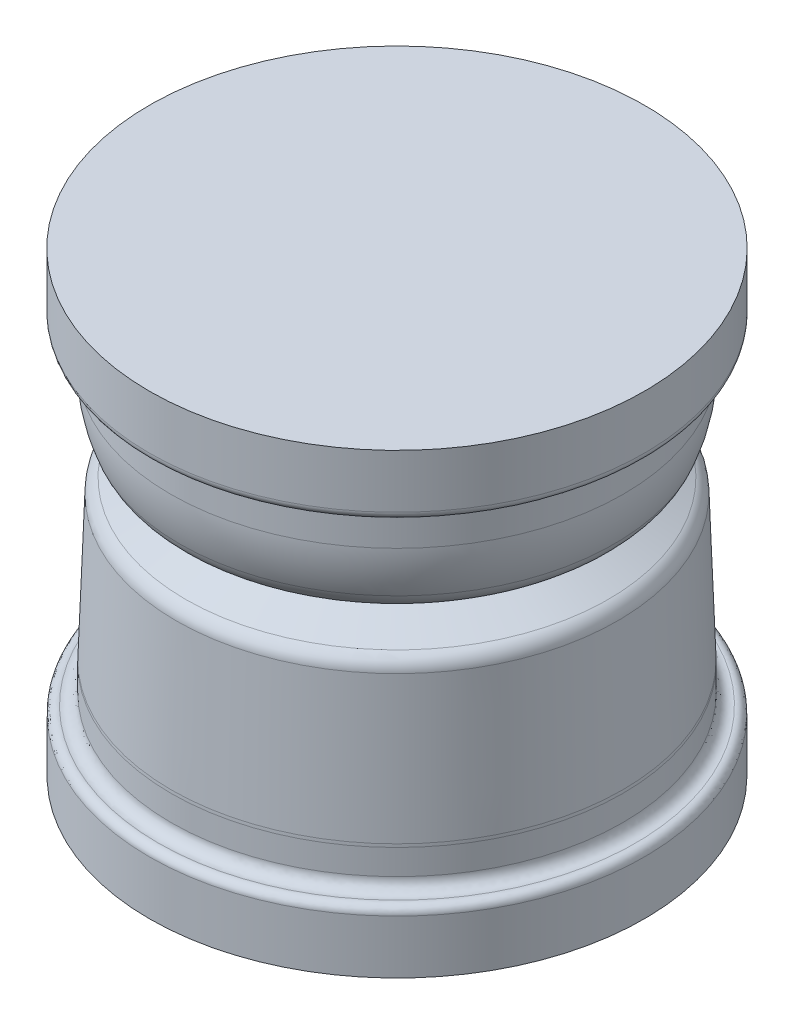
ISO-10303-21;
HEADER;
FILE_DESCRIPTION(('STEP AP214'),'2;1');
FILE_NAME('part.step','',(''),(''),'','','');
FILE_SCHEMA(('AUTOMOTIVE_DESIGN { 1 0 10303 214 1 1 1 1 }'));
ENDSEC;
DATA;
#1=APPLICATION_CONTEXT('core data for automotive mechanical design processes');
#2=APPLICATION_PROTOCOL_DEFINITION('international standard','automotive_design',2000,#1);
#3=PRODUCT_CONTEXT('',#1,'mechanical');
#4=PRODUCT('Part','Part','',(#3));
#5=PRODUCT_RELATED_PRODUCT_CATEGORY('part','',(#4));
#6=PRODUCT_DEFINITION_FORMATION('','',#4);
#7=PRODUCT_DEFINITION_CONTEXT('part definition',#1,'design');
#8=PRODUCT_DEFINITION('design','',#6,#7);
#9=PRODUCT_DEFINITION_SHAPE('','',#8);
#10=(LENGTH_UNIT() NAMED_UNIT(*) SI_UNIT(.MILLI.,.METRE.));
#11=(NAMED_UNIT(*) PLANE_ANGLE_UNIT() SI_UNIT($,.RADIAN.));
#12=(NAMED_UNIT(*) SI_UNIT($,.STERADIAN.) SOLID_ANGLE_UNIT());
#13=UNCERTAINTY_MEASURE_WITH_UNIT(LENGTH_MEASURE(1.E-05),#10,'distance_accuracy_value','');
#14=(GEOMETRIC_REPRESENTATION_CONTEXT(3) GLOBAL_UNCERTAINTY_ASSIGNED_CONTEXT((#13)) GLOBAL_UNIT_ASSIGNED_CONTEXT((#10,
#11,#12)) REPRESENTATION_CONTEXT('',''));
#15=CARTESIAN_POINT('',(0.,0.,0.));
#16=DIRECTION('',(0.,0.,1.));
#17=DIRECTION('',(1.,0.,0.));
#18=AXIS2_PLACEMENT_3D('',#15,#16,#17);
#19=CARTESIAN_POINT('',(0.,-108.124708626121,133.519735500002));
#20=CARTESIAN_POINT('',(0.,-108.789131090786,128.834697888006));
#21=CARTESIAN_POINT('',(0.,-105.359484803612,126.302452500002));
#22=CARTESIAN_POINT('',(0.,-101.837246578522,126.302452500002));
#23=(BOUNDED_CURVE() B_SPLINE_CURVE(3,(#19,#20,#21,#22),.UNSPECIFIED.,.F.,
.F.) B_SPLINE_CURVE_WITH_KNOTS((4,4),(0.,1.),
.UNSPECIFIED.) CURVE() GEOMETRIC_REPRESENTATION_ITEM() RATIONAL_B_SPLINE_CURVE((0.255591691964593,
0.242825015050018,0.327183181081988,0.508666190060503)) REPRESENTATION_ITEM(''));
#24=CARTESIAN_POINT('',(0.,55.,0.));
#25=DIRECTION('',(0.,1.,0.));
#26=AXIS1_PLACEMENT('',#24,#25);
#27=SURFACE_OF_REVOLUTION('',#23,#26);
#28=CARTESIAN_POINT('',(0.,-101.837246578522,0.));
#29=DIRECTION('',(0.,1.,0.));
#30=DIRECTION('',(0.,0.,1.));
#31=AXIS2_PLACEMENT_3D('',#28,#29,#30);
#32=CIRCLE('',#31,126.302452500002);
#33=CARTESIAN_POINT('',(0.,-101.837246578522,126.302452500002));
#34=VERTEX_POINT('',#33);
#35=EDGE_CURVE('E93',#34,#34,#32,.T.);
#36=ORIENTED_EDGE('',*,*,#35,.F.);
#37=EDGE_LOOP('',(#36));
#38=FACE_BOUND('',#37,.T.);
#39=CARTESIAN_POINT('',(0.,-108.124708626121,0.));
#40=DIRECTION('',(0.,1.,0.));
#41=DIRECTION('',(0.,0.,1.));
#42=AXIS2_PLACEMENT_3D('',#39,#40,#41);
#43=CIRCLE('',#42,133.519735500002);
#44=CARTESIAN_POINT('',(0.,-108.124708626121,133.519735500002));
#45=VERTEX_POINT('',#44);
#46=EDGE_CURVE('E10',#45,#45,#43,.T.);
#47=ORIENTED_EDGE('',*,*,#46,.T.);
#48=EDGE_LOOP('',(#47));
#49=FACE_BOUND('',#48,.T.);
#50=ADVANCED_FACE('F34',(#38,#49),#27,.T.);
#51=CARTESIAN_POINT('',(0.,-108.124708626121,133.519735500002));
#52=CARTESIAN_POINT('',(0.,-107.672901350149,136.70556107616));
#53=CARTESIAN_POINT('',(0.,-110.005060825427,138.427487940002));
#54=CARTESIAN_POINT('',(0.,-112.400182818489,138.427487940002));
#55=(BOUNDED_CURVE() B_SPLINE_CURVE(3,(#51,#52,#53,#54),.UNSPECIFIED.,.F.,
.F.) B_SPLINE_CURVE_WITH_KNOTS((4,4),(0.,1.),
.UNSPECIFIED.) CURVE() GEOMETRIC_REPRESENTATION_ITEM() RATIONAL_B_SPLINE_CURVE((0.255591691964592,
0.242825015050017,0.327183181081988,0.508666190060503)) REPRESENTATION_ITEM(''));
#56=CARTESIAN_POINT('',(0.,55.,0.));
#57=DIRECTION('',(0.,1.,0.));
#58=AXIS1_PLACEMENT('',#56,#57);
#59=SURFACE_OF_REVOLUTION('',#55,#58);
#60=CARTESIAN_POINT('',(0.,-112.400182818489,0.));
#61=DIRECTION('',(0.,1.,0.));
#62=DIRECTION('',(0.,0.,1.));
#63=AXIS2_PLACEMENT_3D('',#60,#61,#62);
#64=CIRCLE('',#63,138.427487940002);
#65=CARTESIAN_POINT('',(0.,-112.400182818489,138.427487940002));
#66=VERTEX_POINT('',#65);
#67=EDGE_CURVE('E41',#66,#66,#64,.T.);
#68=ORIENTED_EDGE('',*,*,#67,.T.);
#69=EDGE_LOOP('',(#68));
#70=FACE_BOUND('',#69,.T.);
#71=ORIENTED_EDGE('',*,*,#46,.F.);
#72=EDGE_LOOP('',(#71));
#73=FACE_BOUND('',#72,.T.);
#74=ADVANCED_FACE('F157',(#70,#73),#59,.F.);
#75=CARTESIAN_POINT('',(0.,55.,0.));
#76=DIRECTION('',(0.,1.,0.));
#77=DIRECTION('',(0.,0.,1.));
#78=AXIS2_PLACEMENT_3D('',#75,#76,#77);
#79=CYLINDRICAL_SURFACE('',#78,138.427487940002);
#80=CARTESIAN_POINT('',(0.,-142.400182818489,0.));
#81=DIRECTION('',(0.,1.,0.));
#82=DIRECTION('',(0.,0.,1.));
#83=AXIS2_PLACEMENT_3D('',#80,#81,#82);
#84=CIRCLE('',#83,138.427487940002);
#85=CARTESIAN_POINT('',(0.,-142.400182818489,138.427487940002));
#86=VERTEX_POINT('',#85);
#87=EDGE_CURVE('E45',#86,#86,#84,.T.);
#88=ORIENTED_EDGE('',*,*,#87,.T.);
#89=EDGE_LOOP('',(#88));
#90=FACE_BOUND('',#89,.T.);
#91=ORIENTED_EDGE('',*,*,#67,.F.);
#92=EDGE_LOOP('',(#91));
#93=FACE_BOUND('',#92,.T.);
#94=ADVANCED_FACE('F154',(#90,#93),#79,.T.);
#95=CARTESIAN_POINT('',(0.,-142.400182818489,0.));
#96=DIRECTION('',(0.,1.,0.));
#97=DIRECTION('',(0.,0.,1.));
#98=AXIS2_PLACEMENT_3D('',#95,#96,#97);
#99=PLANE('',#98);
#100=ORIENTED_EDGE('',*,*,#87,.F.);
#101=EDGE_LOOP('',(#100));
#102=FACE_BOUND('',#101,.T.);
#103=ADVANCED_FACE('F150',(#102),#99,.F.);
#104=CARTESIAN_POINT('',(0.,113.365316058993,0.));
#105=DIRECTION('',(0.,-1.,0.));
#106=DIRECTION('',(0.,0.,-1.));
#107=AXIS2_PLACEMENT_3D('',#104,#105,#106);
#108=PLANE('',#107);
#109=CARTESIAN_POINT('',(0.,113.365316058993,0.));
#110=DIRECTION('',(0.,1.,0.));
#111=DIRECTION('',(0.,0.,1.));
#112=AXIS2_PLACEMENT_3D('',#109,#110,#111);
#113=CIRCLE('',#112,138.555289406168);
#114=CARTESIAN_POINT('',(0.,113.365316058993,138.555289406168));
#115=VERTEX_POINT('',#114);
#116=EDGE_CURVE('E49',#115,#115,#113,.T.);
#117=ORIENTED_EDGE('',*,*,#116,.T.);
#118=EDGE_LOOP('',(#117));
#119=FACE_BOUND('',#118,.T.);
#120=ADVANCED_FACE('F146',(#119),#108,.F.);
#121=CARTESIAN_POINT('',(0.,55.,0.));
#122=DIRECTION('',(0.,1.,0.));
#123=DIRECTION('',(0.,0.,1.));
#124=AXIS2_PLACEMENT_3D('',#121,#122,#123);
#125=CYLINDRICAL_SURFACE('',#124,138.555289406168);
#126=ORIENTED_EDGE('',*,*,#116,.F.);
#127=EDGE_LOOP('',(#126));
#128=FACE_BOUND('',#127,.T.);
#129=CARTESIAN_POINT('',(0.,83.3653160589928,0.));
#130=DIRECTION('',(0.,1.,0.));
#131=DIRECTION('',(0.,0.,1.));
#132=AXIS2_PLACEMENT_3D('',#129,#130,#131);
#133=CIRCLE('',#132,138.555289406168);
#134=CARTESIAN_POINT('',(0.,83.3653160589928,138.555289406168));
#135=VERTEX_POINT('',#134);
#136=EDGE_CURVE('E54',#135,#135,#133,.T.);
#137=ORIENTED_EDGE('',*,*,#136,.T.);
#138=EDGE_LOOP('',(#137));
#139=FACE_BOUND('',#138,.T.);
#140=ADVANCED_FACE('F142',(#128,#139),#125,.T.);
#141=CARTESIAN_POINT('',(0.,83.2420105318187,0.));
#142=DIRECTION('',(0.,1.,0.));
#143=DIRECTION('',(0.,0.,1.));
#144=AXIS2_PLACEMENT_3D('',#141,#142,#143);
#145=TOROIDAL_SURFACE('',#144,134.112,4.44499999999991);
#146=CARTESIAN_POINT('',(0.,78.8192913738797,0.));
#147=DIRECTION('',(0.,1.,0.));
#148=DIRECTION('',(0.,0.,1.));
#149=AXIS2_PLACEMENT_3D('',#146,#147,#148);
#150=CIRCLE('',#149,133.667500000001);
#151=CARTESIAN_POINT('',(0.,78.8192913738797,133.667500000001));
#152=VERTEX_POINT('',#151);
#153=EDGE_CURVE('E57',#152,#152,#150,.T.);
#154=ORIENTED_EDGE('',*,*,#153,.T.);
#155=EDGE_LOOP('',(#154));
#156=FACE_BOUND('',#155,.T.);
#157=ORIENTED_EDGE('',*,*,#136,.F.);
#158=EDGE_LOOP('',(#157));
#159=FACE_BOUND('',#158,.T.);
#160=ADVANCED_FACE('F138',(#156,#159),#145,.T.);
#161=CARTESIAN_POINT('',(0.,72.5011211482528,0.));
#162=DIRECTION('',(0.,1.,0.));
#163=DIRECTION('',(0.,0.,1.));
#164=AXIS2_PLACEMENT_3D('',#161,#162,#163);
#165=TOROIDAL_SURFACE('',#164,133.0325,6.34999999999996);
#166=ORIENTED_EDGE('',*,*,#153,.F.);
#167=EDGE_LOOP('',(#166));
#168=FACE_BOUND('',#167,.T.);
#169=CARTESIAN_POINT('',(0.,72.5011211482528,0.));
#170=DIRECTION('',(0.,1.,0.));
#171=DIRECTION('',(0.,0.,1.));
#172=AXIS2_PLACEMENT_3D('',#169,#170,#171);
#173=CIRCLE('',#172,126.6825);
#174=CARTESIAN_POINT('',(0.,72.5011211482528,126.6825));
#175=VERTEX_POINT('',#174);
#176=EDGE_CURVE('E60',#175,#175,#173,.T.);
#177=ORIENTED_EDGE('',*,*,#176,.T.);
#178=EDGE_LOOP('',(#177));
#179=FACE_BOUND('',#178,.T.);
#180=ADVANCED_FACE('F134',(#168,#179),#165,.F.);
#181=CARTESIAN_POINT('',(0.,55.,0.));
#182=DIRECTION('',(0.,1.,0.));
#183=DIRECTION('',(0.,0.,1.));
#184=AXIS2_PLACEMENT_3D('',#181,#182,#183);
#185=CYLINDRICAL_SURFACE('',#184,126.6825);
#186=CARTESIAN_POINT('',(0.,57.5011211482528,0.));
#187=DIRECTION('',(0.,1.,0.));
#188=DIRECTION('',(0.,0.,1.));
#189=AXIS2_PLACEMENT_3D('',#186,#187,#188);
#190=CIRCLE('',#189,126.6825);
#191=CARTESIAN_POINT('',(0.,57.5011211482528,126.6825));
#192=VERTEX_POINT('',#191);
#193=EDGE_CURVE('E63',#192,#192,#190,.T.);
#194=ORIENTED_EDGE('',*,*,#193,.T.);
#195=EDGE_LOOP('',(#194));
#196=FACE_BOUND('',#195,.T.);
#197=ORIENTED_EDGE('',*,*,#176,.F.);
#198=EDGE_LOOP('',(#197));
#199=FACE_BOUND('',#198,.T.);
#200=ADVANCED_FACE('F130',(#196,#199),#185,.T.);
#201=CARTESIAN_POINT('',(0.,57.5011211482528,0.));
#202=DIRECTION('',(0.,1.,0.));
#203=DIRECTION('',(0.,0.,1.));
#204=AXIS2_PLACEMENT_3D('',#201,#202,#203);
#205=DEGENERATE_TOROIDAL_SURFACE('',#204,54.0473043126088,72.6351956873913,.T.);
#206=ORIENTED_EDGE('',*,*,#193,.F.);
#207=EDGE_LOOP('',(#206));
#208=FACE_BOUND('',#207,.T.);
#209=CARTESIAN_POINT('',(0.,30.8840402786734,0.));
#210=DIRECTION('',(0.,1.,0.));
#211=DIRECTION('',(0.,0.,1.));
#212=AXIS2_PLACEMENT_3D('',#209,#210,#211);
#213=CIRCLE('',#212,121.629866105781);
#214=CARTESIAN_POINT('',(0.,30.8840402786734,121.629866105781));
#215=VERTEX_POINT('',#214);
#216=EDGE_CURVE('E66',#215,#215,#213,.T.);
#217=ORIENTED_EDGE('',*,*,#216,.T.);
#218=EDGE_LOOP('',(#217));
#219=FACE_BOUND('',#218,.T.);
#220=ADVANCED_FACE('F126',(#208,#219),#205,.T.);
#221=CARTESIAN_POINT('',(0.,37.6315363697442,0.));
#222=DIRECTION('',(0.,1.,0.));
#223=DIRECTION('',(0.,0.,1.));
#224=AXIS2_PLACEMENT_3D('',#221,#222,#223);
#225=TOROIDAL_SURFACE('',#224,104.49751888264,18.4132024610953);
#226=CARTESIAN_POINT('',(0.,20.9524825050762,0.));
#227=DIRECTION('',(0.,1.,0.));
#228=DIRECTION('',(0.,0.,1.));
#229=AXIS2_PLACEMENT_3D('',#226,#227,#228);
#230=CIRCLE('',#229,112.298492350919);
#231=CARTESIAN_POINT('',(0.,20.9524825050762,112.298492350919));
#232=VERTEX_POINT('',#231);
#233=EDGE_CURVE('E69',#232,#232,#230,.T.);
#234=ORIENTED_EDGE('',*,*,#233,.T.);
#235=EDGE_LOOP('',(#234));
#236=FACE_BOUND('',#235,.T.);
#237=ORIENTED_EDGE('',*,*,#216,.F.);
#238=EDGE_LOOP('',(#237));
#239=FACE_BOUND('',#238,.T.);
#240=ADVANCED_FACE('F122',(#236,#239),#225,.T.);
#241=CARTESIAN_POINT('',(0.,14.832128030832,0.));
#242=DIRECTION('',(0.,1.,0.));
#243=DIRECTION('',(0.,0.,1.));
#244=AXIS2_PLACEMENT_3D('',#241,#242,#243);
#245=CONICAL_SURFACE('',#244,99.2127252525066,1.13331210913786);
#246=ORIENTED_EDGE('',*,*,#233,.F.);
#247=EDGE_LOOP('',(#246));
#248=FACE_BOUND('',#247,.T.);
#249=CARTESIAN_POINT('',(0.,14.832128030832,0.));
#250=DIRECTION('',(0.,1.,0.));
#251=DIRECTION('',(0.,0.,1.));
#252=AXIS2_PLACEMENT_3D('',#249,#250,#251);
#253=CIRCLE('',#252,99.2127252525066);
#254=CARTESIAN_POINT('',(0.,14.832128030832,99.2127252525066));
#255=VERTEX_POINT('',#254);
#256=EDGE_CURVE('E72',#255,#255,#253,.T.);
#257=ORIENTED_EDGE('',*,*,#256,.T.);
#258=EDGE_LOOP('',(#257));
#259=FACE_BOUND('',#258,.T.);
#260=ADVANCED_FACE('F118',(#248,#259),#245,.T.);
#261=CARTESIAN_POINT('',(0.,13.0472913738795,91.1860000000004));
#262=CARTESIAN_POINT('',(0.,13.0472913738794,93.9930756489206));
#263=CARTESIAN_POINT('',(0.,13.6614165071201,96.7096580848795));
#264=CARTESIAN_POINT('',(0.,14.832128030832,99.2127252525066));
#265=(BOUNDED_CURVE() B_SPLINE_CURVE(3,(#261,#262,#263,#264),.UNSPECIFIED.,.F.,
.F.) B_SPLINE_CURVE_WITH_KNOTS((4,4),(0.,1.),
.UNSPECIFIED.) CURVE() GEOMETRIC_REPRESENTATION_ITEM() RATIONAL_B_SPLINE_CURVE((0.254333095030252,
0.254333095030252,0.258499793724843,0.266833191114025)) REPRESENTATION_ITEM(''));
#266=CARTESIAN_POINT('',(0.,55.,0.));
#267=DIRECTION('',(0.,1.,0.));
#268=AXIS1_PLACEMENT('',#266,#267);
#269=SURFACE_OF_REVOLUTION('',#265,#268);
#270=ORIENTED_EDGE('',*,*,#256,.F.);
#271=EDGE_LOOP('',(#270));
#272=FACE_BOUND('',#271,.T.);
#273=CARTESIAN_POINT('',(0.,13.0472913738796,0.));
#274=DIRECTION('',(0.,1.,0.));
#275=DIRECTION('',(0.,0.,1.));
#276=AXIS2_PLACEMENT_3D('',#273,#274,#275);
#277=CIRCLE('',#276,91.1860000000005);
#278=CARTESIAN_POINT('',(0.,13.0472913738796,91.1860000000005));
#279=VERTEX_POINT('',#278);
#280=EDGE_CURVE('E75',#279,#279,#277,.T.);
#281=ORIENTED_EDGE('',*,*,#280,.T.);
#282=EDGE_LOOP('',(#281));
#283=FACE_BOUND('',#282,.T.);
#284=ADVANCED_FACE('F113',(#272,#283),#269,.T.);
#285=CARTESIAN_POINT('',(0.,13.0472913738796,91.1860000000004));
#286=CARTESIAN_POINT('',(0.,13.0472913738796,93.9930756489206));
#287=CARTESIAN_POINT('',(0.,12.4331662406387,96.7096580848795));
#288=CARTESIAN_POINT('',(0.,11.2624547169268,99.2127252525065));
#289=(BOUNDED_CURVE() B_SPLINE_CURVE(3,(#285,#286,#287,#288),.UNSPECIFIED.,.F.,
.F.) B_SPLINE_CURVE_WITH_KNOTS((4,4),(0.,1.),
.UNSPECIFIED.) CURVE() GEOMETRIC_REPRESENTATION_ITEM() RATIONAL_B_SPLINE_CURVE((0.254333095030252,
0.254333095030252,0.258499793724843,0.266833191114025)) REPRESENTATION_ITEM(''));
#290=CARTESIAN_POINT('',(0.,55.,0.));
#291=DIRECTION('',(0.,1.,0.));
#292=AXIS1_PLACEMENT('',#290,#291);
#293=SURFACE_OF_REVOLUTION('',#289,#292);
#294=CARTESIAN_POINT('',(0.,11.2624547169268,0.));
#295=DIRECTION('',(0.,1.,0.));
#296=DIRECTION('',(0.,0.,1.));
#297=AXIS2_PLACEMENT_3D('',#294,#295,#296);
#298=CIRCLE('',#297,99.2127252525065);
#299=CARTESIAN_POINT('',(0.,11.2624547169268,99.2127252525065));
#300=VERTEX_POINT('',#299);
#301=EDGE_CURVE('E78',#300,#300,#298,.T.);
#302=ORIENTED_EDGE('',*,*,#301,.T.);
#303=EDGE_LOOP('',(#302));
#304=FACE_BOUND('',#303,.T.);
#305=ORIENTED_EDGE('',*,*,#280,.F.);
#306=EDGE_LOOP('',(#305));
#307=FACE_BOUND('',#306,.T.);
#308=ADVANCED_FACE('F108',(#304,#307),#293,.F.);
#309=CARTESIAN_POINT('',(0.,11.2624547169268,0.));
#310=DIRECTION('',(0.,-1.,0.));
#311=DIRECTION('',(0.,0.,-1.));
#312=AXIS2_PLACEMENT_3D('',#309,#310,#311);
#313=CONICAL_SURFACE('',#312,99.2127252525065,1.13331210913781);
#314=CARTESIAN_POINT('',(0.,2.34433380954261,0.));
#315=DIRECTION('',(0.,1.,0.));
#316=DIRECTION('',(0.,0.,1.));
#317=AXIS2_PLACEMENT_3D('',#314,#315,#316);
#318=CIRCLE('',#317,118.280322340321);
#319=CARTESIAN_POINT('',(0.,2.34433380954261,118.280322340321));
#320=VERTEX_POINT('',#319);
#321=EDGE_CURVE('E81',#320,#320,#318,.T.);
#322=ORIENTED_EDGE('',*,*,#321,.T.);
#323=EDGE_LOOP('',(#322));
#324=FACE_BOUND('',#323,.T.);
#325=ORIENTED_EDGE('',*,*,#301,.F.);
#326=EDGE_LOOP('',(#325));
#327=FACE_BOUND('',#326,.T.);
#328=ADVANCED_FACE('F112',(#324,#327),#313,.T.);
#329=CARTESIAN_POINT('',(0.,-5.80804951971132,0.));
#330=DIRECTION('',(0.,1.,0.));
#331=DIRECTION('',(0.,0.,1.));
#332=AXIS2_PLACEMENT_3D('',#329,#330,#331);
#333=TOROIDAL_SURFACE('',#332,114.46736468872,9.);
#334=CARTESIAN_POINT('',(0.,-5.49395404938885,0.));
#335=DIRECTION('',(0.,1.,0.));
#336=DIRECTION('',(0.,0.,1.));
#337=AXIS2_PLACEMENT_3D('',#334,#335,#336);
#338=CIRCLE('',#337,123.461882131892);
#339=CARTESIAN_POINT('',(0.,-5.49395404938885,123.461882131892));
#340=VERTEX_POINT('',#339);
#341=EDGE_CURVE('E84',#340,#340,#338,.T.);
#342=ORIENTED_EDGE('',*,*,#341,.T.);
#343=EDGE_LOOP('',(#342));
#344=FACE_BOUND('',#343,.T.);
#345=ORIENTED_EDGE('',*,*,#321,.F.);
#346=EDGE_LOOP('',(#345));
#347=FACE_BOUND('',#346,.T.);
#348=ADVANCED_FACE('F195',(#344,#347),#333,.T.);
#349=CARTESIAN_POINT('',(0.,-5.49395404938885,0.));
#350=DIRECTION('',(0.,-1.,0.));
#351=DIRECTION('',(0.,0.,-1.));
#352=AXIS2_PLACEMENT_3D('',#349,#350,#351);
#353=CONICAL_SURFACE('',#352,123.461882131892,0.0349065850398867);
#354=CARTESIAN_POINT('',(0.,-85.9650249898077,0.));
#355=DIRECTION('',(0.,1.,0.));
#356=DIRECTION('',(0.,0.,1.));
#357=AXIS2_PLACEMENT_3D('',#354,#355,#356);
#358=CIRCLE('',#357,126.271993850957);
#359=CARTESIAN_POINT('',(0.,-85.9650249898077,126.271993850957));
#360=VERTEX_POINT('',#359);
#361=EDGE_CURVE('E87',#360,#360,#358,.T.);
#362=ORIENTED_EDGE('',*,*,#361,.T.);
#363=EDGE_LOOP('',(#362));
#364=FACE_BOUND('',#363,.T.);
#365=ORIENTED_EDGE('',*,*,#341,.F.);
#366=EDGE_LOOP('',(#365));
#367=FACE_BOUND('',#366,.T.);
#368=ADVANCED_FACE('F189',(#364,#367),#353,.T.);
#369=CARTESIAN_POINT('',(0.,-87.709999824933,0.));
#370=DIRECTION('',(0.,1.,0.));
#371=DIRECTION('',(0.,0.,1.));
#372=AXIS2_PLACEMENT_3D('',#369,#370,#371);
#373=TOROIDAL_SURFACE('',#372,76.302452500002,50.);
#374=ORIENTED_EDGE('',*,*,#361,.F.);
#375=EDGE_LOOP('',(#374));
#376=FACE_BOUND('',#375,.T.);
#377=CARTESIAN_POINT('',(0.,-87.7099998249327,0.));
#378=DIRECTION('',(0.,1.,0.));
#379=DIRECTION('',(0.,0.,1.));
#380=AXIS2_PLACEMENT_3D('',#377,#378,#379);
#381=CIRCLE('',#380,126.302452500002);
#382=CARTESIAN_POINT('',(0.,-87.7099998249327,126.302452500002));
#383=VERTEX_POINT('',#382);
#384=EDGE_CURVE('E90',#383,#383,#381,.T.);
#385=ORIENTED_EDGE('',*,*,#384,.T.);
#386=EDGE_LOOP('',(#385));
#387=FACE_BOUND('',#386,.T.);
#388=ADVANCED_FACE('F184',(#376,#387),#373,.T.);
#389=CARTESIAN_POINT('',(0.,55.,0.));
#390=DIRECTION('',(0.,1.,0.));
#391=DIRECTION('',(0.,0.,1.));
#392=AXIS2_PLACEMENT_3D('',#389,#390,#391);
#393=CYLINDRICAL_SURFACE('',#392,126.302452500002);
#394=ORIENTED_EDGE('',*,*,#35,.T.);
#395=EDGE_LOOP('',(#394));
#396=FACE_BOUND('',#395,.T.);
#397=ORIENTED_EDGE('',*,*,#384,.F.);
#398=EDGE_LOOP('',(#397));
#399=FACE_BOUND('',#398,.T.);
#400=ADVANCED_FACE('F181',(#396,#399),#393,.T.);
#401=CLOSED_SHELL('',(#50,#74,#94,#103,#120,#140,#160,#180,#200,#220,#240,#260,#284,#308,#328,
#348,#368,#388,#400));
#402=MANIFOLD_SOLID_BREP('B2',#401);
#403=ADVANCED_BREP_SHAPE_REPRESENTATION('',(#18,#402),#14);
#404=SHAPE_DEFINITION_REPRESENTATION(#9,#403);
ENDSEC;
END-ISO-10303-21;
